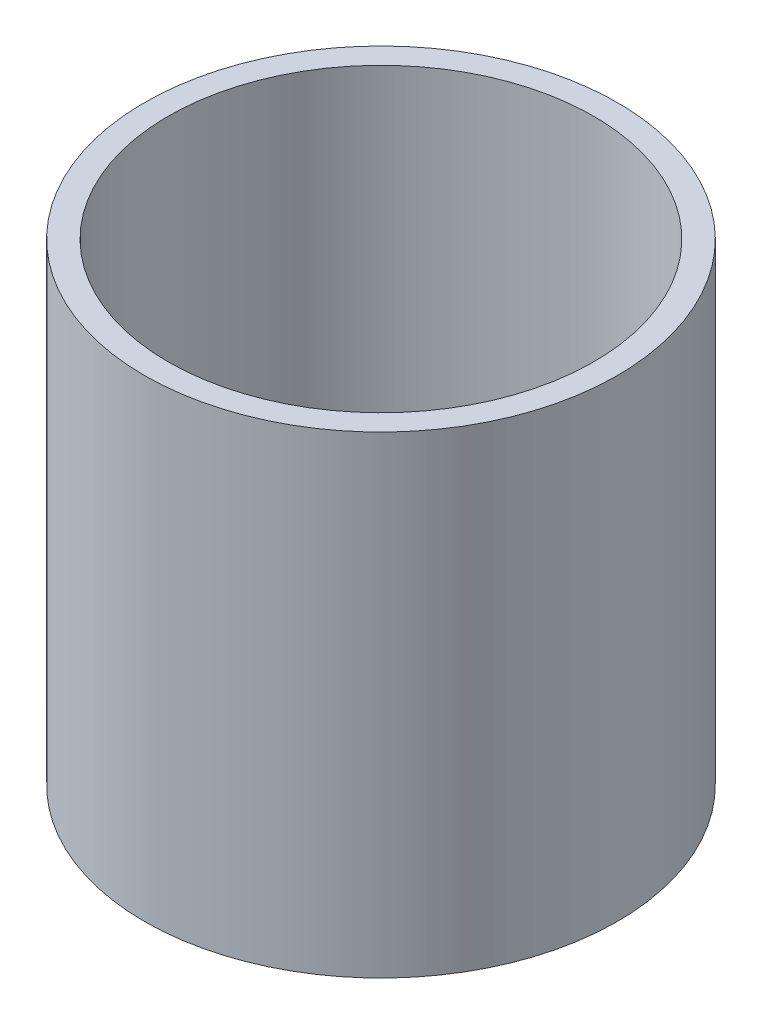
ISO-10303-21;
HEADER;
FILE_DESCRIPTION(('STEP AP214'),'2;1');
FILE_NAME('part.step','',(''),(''),'','','');
FILE_SCHEMA(('AUTOMOTIVE_DESIGN { 1 0 10303 214 1 1 1 1 }'));
ENDSEC;
DATA;
#1=APPLICATION_CONTEXT('core data for automotive mechanical design processes');
#2=APPLICATION_PROTOCOL_DEFINITION('international standard','automotive_design',2000,#1);
#3=PRODUCT_CONTEXT('',#1,'mechanical');
#4=PRODUCT('Part','Part','',(#3));
#5=PRODUCT_RELATED_PRODUCT_CATEGORY('part','',(#4));
#6=PRODUCT_DEFINITION_FORMATION('','',#4);
#7=PRODUCT_DEFINITION_CONTEXT('part definition',#1,'design');
#8=PRODUCT_DEFINITION('design','',#6,#7);
#9=PRODUCT_DEFINITION_SHAPE('','',#8);
#10=(LENGTH_UNIT() NAMED_UNIT(*) SI_UNIT(.MILLI.,.METRE.));
#11=(NAMED_UNIT(*) PLANE_ANGLE_UNIT() SI_UNIT($,.RADIAN.));
#12=(NAMED_UNIT(*) SI_UNIT($,.STERADIAN.) SOLID_ANGLE_UNIT());
#13=UNCERTAINTY_MEASURE_WITH_UNIT(LENGTH_MEASURE(1.E-05),#10,'distance_accuracy_value','');
#14=(GEOMETRIC_REPRESENTATION_CONTEXT(3) GLOBAL_UNCERTAINTY_ASSIGNED_CONTEXT((#13)) GLOBAL_UNIT_ASSIGNED_CONTEXT((#10,
#11,#12)) REPRESENTATION_CONTEXT('',''));
#15=CARTESIAN_POINT('',(0.,0.,0.));
#16=DIRECTION('',(0.,0.,1.));
#17=DIRECTION('',(1.,0.,0.));
#18=AXIS2_PLACEMENT_3D('',#15,#16,#17);
#19=CARTESIAN_POINT('',(0.,100.,0.));
#20=DIRECTION('',(0.,1.,0.));
#21=DIRECTION('',(0.,0.,1.));
#22=AXIS2_PLACEMENT_3D('',#19,#20,#21);
#23=PLANE('',#22);
#24=CARTESIAN_POINT('',(0.,100.,0.));
#25=DIRECTION('',(0.,1.,0.));
#26=DIRECTION('',(0.,0.,1.));
#27=AXIS2_PLACEMENT_3D('',#24,#25,#26);
#28=CIRCLE('',#27,50.);
#29=CARTESIAN_POINT('',(0.,100.,50.));
#30=VERTEX_POINT('',#29);
#31=EDGE_CURVE('E10',#30,#30,#28,.T.);
#32=ORIENTED_EDGE('',*,*,#31,.T.);
#33=EDGE_LOOP('',(#32));
#34=FACE_BOUND('',#33,.T.);
#35=CARTESIAN_POINT('',(0.,100.,0.));
#36=DIRECTION('',(0.,1.,0.));
#37=DIRECTION('',(0.,0.,1.));
#38=AXIS2_PLACEMENT_3D('',#35,#36,#37);
#39=CIRCLE('',#38,45.);
#40=CARTESIAN_POINT('',(0.,100.,45.));
#41=VERTEX_POINT('',#40);
#42=EDGE_CURVE('E50',#41,#41,#39,.T.);
#43=ORIENTED_EDGE('',*,*,#42,.F.);
#44=EDGE_LOOP('',(#43));
#45=FACE_BOUND('',#44,.T.);
#46=ADVANCED_FACE('F37',(#34,#45),#23,.T.);
#47=CARTESIAN_POINT('',(0.,0.,0.));
#48=DIRECTION('',(0.,1.,0.));
#49=DIRECTION('',(0.,0.,1.));
#50=AXIS2_PLACEMENT_3D('',#47,#48,#49);
#51=PLANE('',#50);
#52=CARTESIAN_POINT('',(0.,0.,0.));
#53=DIRECTION('',(0.,1.,0.));
#54=DIRECTION('',(0.,0.,1.));
#55=AXIS2_PLACEMENT_3D('',#52,#53,#54);
#56=CIRCLE('',#55,50.);
#57=CARTESIAN_POINT('',(0.,0.,50.));
#58=VERTEX_POINT('',#57);
#59=EDGE_CURVE('E41',#58,#58,#56,.T.);
#60=ORIENTED_EDGE('',*,*,#59,.F.);
#61=EDGE_LOOP('',(#60));
#62=FACE_BOUND('',#61,.T.);
#63=CARTESIAN_POINT('',(0.,0.,0.));
#64=DIRECTION('',(0.,1.,0.));
#65=DIRECTION('',(0.,0.,1.));
#66=AXIS2_PLACEMENT_3D('',#63,#64,#65);
#67=CIRCLE('',#66,45.);
#68=CARTESIAN_POINT('',(0.,0.,45.));
#69=VERTEX_POINT('',#68);
#70=EDGE_CURVE('E52',#69,#69,#67,.T.);
#71=ORIENTED_EDGE('',*,*,#70,.T.);
#72=EDGE_LOOP('',(#71));
#73=FACE_BOUND('',#72,.T.);
#74=ADVANCED_FACE('F64',(#62,#73),#51,.F.);
#75=CARTESIAN_POINT('',(0.,100.,0.));
#76=DIRECTION('',(0.,-1.,0.));
#77=DIRECTION('',(0.,0.,-1.));
#78=AXIS2_PLACEMENT_3D('',#75,#76,#77);
#79=CYLINDRICAL_SURFACE('',#78,50.);
#80=ORIENTED_EDGE('',*,*,#31,.F.);
#81=EDGE_LOOP('',(#80));
#82=FACE_BOUND('',#81,.T.);
#83=ORIENTED_EDGE('',*,*,#59,.T.);
#84=EDGE_LOOP('',(#83));
#85=FACE_BOUND('',#84,.T.);
#86=ADVANCED_FACE('F39',(#82,#85),#79,.T.);
#87=CARTESIAN_POINT('',(0.,100.,0.));
#88=DIRECTION('',(0.,-1.,0.));
#89=DIRECTION('',(0.,0.,-1.));
#90=AXIS2_PLACEMENT_3D('',#87,#88,#89);
#91=CYLINDRICAL_SURFACE('',#90,45.);
#92=ORIENTED_EDGE('',*,*,#42,.T.);
#93=EDGE_LOOP('',(#92));
#94=FACE_BOUND('',#93,.T.);
#95=ORIENTED_EDGE('',*,*,#70,.F.);
#96=EDGE_LOOP('',(#95));
#97=FACE_BOUND('',#96,.T.);
#98=ADVANCED_FACE('F60',(#94,#97),#91,.F.);
#99=CLOSED_SHELL('',(#46,#74,#86,#98));
#100=MANIFOLD_SOLID_BREP('B2',#99);
#101=ADVANCED_BREP_SHAPE_REPRESENTATION('',(#18,#100),#14);
#102=SHAPE_DEFINITION_REPRESENTATION(#9,#101);
ENDSEC;
END-ISO-10303-21;
